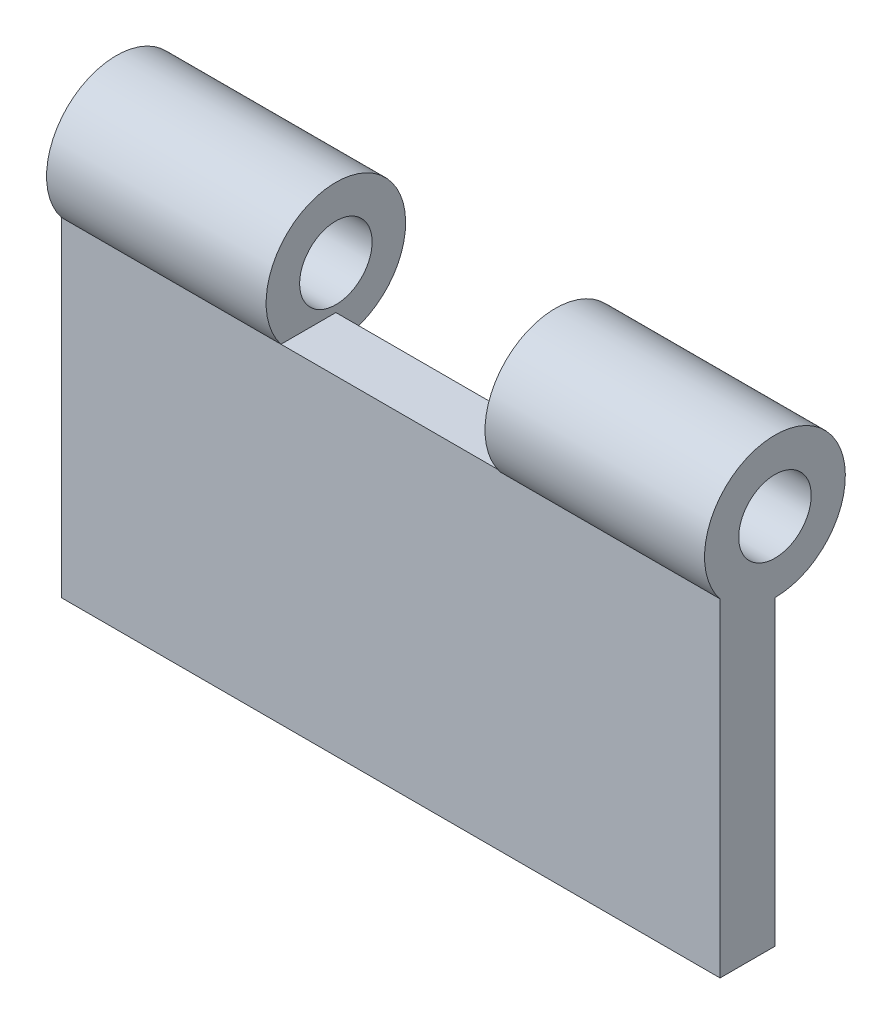
ISO-10303-21;
HEADER;
FILE_DESCRIPTION(('STEP AP214'),'2;1');
FILE_NAME('part.step','',(''),(''),'','','');
FILE_SCHEMA(('AUTOMOTIVE_DESIGN { 1 0 10303 214 1 1 1 1 }'));
ENDSEC;
DATA;
#1=APPLICATION_CONTEXT('core data for automotive mechanical design processes');
#2=APPLICATION_PROTOCOL_DEFINITION('international standard','automotive_design',2000,#1);
#3=PRODUCT_CONTEXT('',#1,'mechanical');
#4=PRODUCT('Part','Part','',(#3));
#5=PRODUCT_RELATED_PRODUCT_CATEGORY('part','',(#4));
#6=PRODUCT_DEFINITION_FORMATION('','',#4);
#7=PRODUCT_DEFINITION_CONTEXT('part definition',#1,'design');
#8=PRODUCT_DEFINITION('design','',#6,#7);
#9=PRODUCT_DEFINITION_SHAPE('','',#8);
#10=(LENGTH_UNIT() NAMED_UNIT(*) SI_UNIT(.MILLI.,.METRE.));
#11=(NAMED_UNIT(*) PLANE_ANGLE_UNIT() SI_UNIT($,.RADIAN.));
#12=(NAMED_UNIT(*) SI_UNIT($,.STERADIAN.) SOLID_ANGLE_UNIT());
#13=UNCERTAINTY_MEASURE_WITH_UNIT(LENGTH_MEASURE(1.E-05),#10,'distance_accuracy_value','');
#14=(GEOMETRIC_REPRESENTATION_CONTEXT(3) GLOBAL_UNCERTAINTY_ASSIGNED_CONTEXT((#13)) GLOBAL_UNIT_ASSIGNED_CONTEXT((#10,
#11,#12)) REPRESENTATION_CONTEXT('',''));
#15=CARTESIAN_POINT('',(0.,0.,0.));
#16=DIRECTION('',(0.,0.,1.));
#17=DIRECTION('',(1.,0.,0.));
#18=AXIS2_PLACEMENT_3D('',#15,#16,#17);
#19=CARTESIAN_POINT('',(0.,0.,5.));
#20=DIRECTION('',(0.,-1.,0.));
#21=DIRECTION('',(0.,0.,-1.));
#22=AXIS2_PLACEMENT_3D('',#19,#20,#21);
#23=PLANE('',#22);
#24=DIRECTION('',(0.,0.,-1.));
#25=VECTOR('',#24,1.);
#26=CARTESIAN_POINT('',(20.,0.,5.));
#27=LINE('',#26,#25);
#28=CARTESIAN_POINT('',(20.,0.,5.));
#29=VERTEX_POINT('',#28);
#30=CARTESIAN_POINT('',(20.,0.,0.));
#31=VERTEX_POINT('',#30);
#32=EDGE_CURVE('E119',#29,#31,#27,.T.);
#33=ORIENTED_EDGE('',*,*,#32,.F.);
#34=DIRECTION('',(-1.,0.,0.));
#35=VECTOR('',#34,1.);
#36=CARTESIAN_POINT('',(0.,0.,5.));
#37=LINE('',#36,#35);
#38=CARTESIAN_POINT('',(40.,0.,5.));
#39=VERTEX_POINT('',#38);
#40=EDGE_CURVE('E89',#39,#29,#37,.T.);
#41=ORIENTED_EDGE('',*,*,#40,.F.);
#42=DIRECTION('',(0.,0.,1.));
#43=VECTOR('',#42,1.);
#44=CARTESIAN_POINT('',(40.,0.,5.));
#45=LINE('',#44,#43);
#46=CARTESIAN_POINT('',(40.,0.,0.));
#47=VERTEX_POINT('',#46);
#48=EDGE_CURVE('E141',#47,#39,#45,.T.);
#49=ORIENTED_EDGE('',*,*,#48,.F.);
#50=DIRECTION('',(-1.,0.,0.));
#51=VECTOR('',#50,1.);
#52=CARTESIAN_POINT('',(0.,0.,0.));
#53=LINE('',#52,#51);
#54=EDGE_CURVE('E96',#47,#31,#53,.T.);
#55=ORIENTED_EDGE('',*,*,#54,.T.);
#56=EDGE_LOOP('',(#33,#41,#49,#55));
#57=FACE_BOUND('',#56,.T.);
#58=ADVANCED_FACE('F33',(#57),#23,.F.);
#59=CARTESIAN_POINT('',(0.,0.,5.));
#60=DIRECTION('',(1.,0.,0.));
#61=DIRECTION('',(0.,0.,-1.));
#62=AXIS2_PLACEMENT_3D('',#59,#60,#61);
#63=PLANE('',#62);
#64=DIRECTION('',(0.,-1.,0.));
#65=VECTOR('',#64,1.);
#66=CARTESIAN_POINT('',(0.,0.,5.));
#67=LINE('',#66,#65);
#68=CARTESIAN_POINT('',(0.,0.,5.));
#69=VERTEX_POINT('',#68);
#70=CARTESIAN_POINT('',(0.,-30.,5.));
#71=VERTEX_POINT('',#70);
#72=EDGE_CURVE('E99',#69,#71,#67,.T.);
#73=ORIENTED_EDGE('',*,*,#72,.F.);
#74=CARTESIAN_POINT('',(0.,3.92435949552473,0.));
#75=DIRECTION('',(-1.,0.,0.));
#76=DIRECTION('',(0.,0.,1.));
#77=AXIS2_PLACEMENT_3D('',#74,#75,#76);
#78=CIRCLE('',#77,6.35614643082702);
#79=CARTESIAN_POINT('',(0.,-2.4317869353023,0.));
#80=VERTEX_POINT('',#79);
#81=EDGE_CURVE('E48',#69,#80,#78,.T.);
#82=ORIENTED_EDGE('',*,*,#81,.T.);
#83=DIRECTION('',(0.,-1.,0.));
#84=VECTOR('',#83,1.);
#85=CARTESIAN_POINT('',(0.,0.,0.));
#86=LINE('',#85,#84);
#87=CARTESIAN_POINT('',(0.,-30.,0.));
#88=VERTEX_POINT('',#87);
#89=EDGE_CURVE('E80',#80,#88,#86,.T.);
#90=ORIENTED_EDGE('',*,*,#89,.T.);
#91=DIRECTION('',(0.,0.,-1.));
#92=VECTOR('',#91,1.);
#93=CARTESIAN_POINT('',(0.,-30.,5.));
#94=LINE('',#93,#92);
#95=EDGE_CURVE('E75',#71,#88,#94,.T.);
#96=ORIENTED_EDGE('',*,*,#95,.F.);
#97=EDGE_LOOP('',(#73,#82,#90,#96));
#98=FACE_BOUND('',#97,.T.);
#99=CARTESIAN_POINT('',(0.,3.92435949552473,0.));
#100=DIRECTION('',(-1.,0.,0.));
#101=DIRECTION('',(0.,0.,1.));
#102=AXIS2_PLACEMENT_3D('',#99,#100,#101);
#103=CIRCLE('',#102,3.30292672279423);
#104=CARTESIAN_POINT('',(0.,3.92435949552473,3.30292672279423));
#105=VERTEX_POINT('',#104);
#106=EDGE_CURVE('E159',#105,#105,#103,.T.);
#107=ORIENTED_EDGE('',*,*,#106,.F.);
#108=EDGE_LOOP('',(#107));
#109=FACE_BOUND('',#108,.T.);
#110=ADVANCED_FACE('F35',(#98,#109),#63,.F.);
#111=CARTESIAN_POINT('',(0.,-30.,5.));
#112=DIRECTION('',(0.,1.,0.));
#113=DIRECTION('',(0.,0.,1.));
#114=AXIS2_PLACEMENT_3D('',#111,#112,#113);
#115=PLANE('',#114);
#116=DIRECTION('',(1.,0.,0.));
#117=VECTOR('',#116,1.);
#118=CARTESIAN_POINT('',(0.,-30.,0.));
#119=LINE('',#118,#117);
#120=CARTESIAN_POINT('',(60.,-30.,0.));
#121=VERTEX_POINT('',#120);
#122=EDGE_CURVE('E69',#88,#121,#119,.T.);
#123=ORIENTED_EDGE('',*,*,#122,.T.);
#124=DIRECTION('',(0.,0.,-1.));
#125=VECTOR('',#124,1.);
#126=CARTESIAN_POINT('',(60.,-30.,5.));
#127=LINE('',#126,#125);
#128=CARTESIAN_POINT('',(60.,-30.,5.));
#129=VERTEX_POINT('',#128);
#130=EDGE_CURVE('E72',#129,#121,#127,.T.);
#131=ORIENTED_EDGE('',*,*,#130,.F.);
#132=DIRECTION('',(1.,0.,0.));
#133=VECTOR('',#132,1.);
#134=CARTESIAN_POINT('',(0.,-30.,5.));
#135=LINE('',#134,#133);
#136=EDGE_CURVE('E57',#71,#129,#135,.T.);
#137=ORIENTED_EDGE('',*,*,#136,.F.);
#138=ORIENTED_EDGE('',*,*,#95,.T.);
#139=EDGE_LOOP('',(#123,#131,#137,#138));
#140=FACE_BOUND('',#139,.T.);
#141=ADVANCED_FACE('F71',(#140),#115,.F.);
#142=CARTESIAN_POINT('',(60.,0.,5.));
#143=DIRECTION('',(-1.,0.,0.));
#144=DIRECTION('',(0.,-1.,0.));
#145=AXIS2_PLACEMENT_3D('',#142,#143,#144);
#146=PLANE('',#145);
#147=DIRECTION('',(0.,1.,0.));
#148=VECTOR('',#147,1.);
#149=CARTESIAN_POINT('',(60.,0.,0.));
#150=LINE('',#149,#148);
#151=CARTESIAN_POINT('',(60.,-2.48927988427875,0.));
#152=VERTEX_POINT('',#151);
#153=EDGE_CURVE('E79',#121,#152,#150,.T.);
#154=ORIENTED_EDGE('',*,*,#153,.T.);
#155=CARTESIAN_POINT('',(60.,3.92435949552474,0.));
#156=DIRECTION('',(1.,0.,0.));
#157=DIRECTION('',(0.,0.,-1.));
#158=AXIS2_PLACEMENT_3D('',#155,#156,#157);
#159=CIRCLE('',#158,6.41363937980349);
#160=CARTESIAN_POINT('',(60.,-0.092451440300608,5.));
#161=VERTEX_POINT('',#160);
#162=EDGE_CURVE('E145',#152,#161,#159,.T.);
#163=ORIENTED_EDGE('',*,*,#162,.T.);
#164=DIRECTION('',(0.,1.,0.));
#165=VECTOR('',#164,1.);
#166=CARTESIAN_POINT('',(60.,0.,5.));
#167=LINE('',#166,#165);
#168=EDGE_CURVE('E88',#129,#161,#167,.T.);
#169=ORIENTED_EDGE('',*,*,#168,.F.);
#170=ORIENTED_EDGE('',*,*,#130,.T.);
#171=EDGE_LOOP('',(#154,#163,#169,#170));
#172=FACE_BOUND('',#171,.T.);
#173=CARTESIAN_POINT('',(60.,3.92435949552474,0.));
#174=DIRECTION('',(1.,0.,0.));
#175=DIRECTION('',(0.,0.,-1.));
#176=AXIS2_PLACEMENT_3D('',#173,#174,#175);
#177=CIRCLE('',#176,3.30292672279423);
#178=CARTESIAN_POINT('',(60.,3.92435949552474,-3.30292672279423));
#179=VERTEX_POINT('',#178);
#180=EDGE_CURVE('E150',#179,#179,#177,.T.);
#181=ORIENTED_EDGE('',*,*,#180,.F.);
#182=EDGE_LOOP('',(#181));
#183=FACE_BOUND('',#182,.T.);
#184=ADVANCED_FACE('F84',(#172,#183),#146,.F.);
#185=CARTESIAN_POINT('',(0.,0.,5.));
#186=DIRECTION('',(0.,0.,1.));
#187=DIRECTION('',(1.,0.,0.));
#188=AXIS2_PLACEMENT_3D('',#185,#186,#187);
#189=PLANE('',#188);
#190=DIRECTION('',(1.,0.,0.));
#191=VECTOR('',#190,1.);
#192=CARTESIAN_POINT('',(40.,-0.092451440300608,5.));
#193=LINE('',#192,#191);
#194=CARTESIAN_POINT('',(40.,-0.092451440300608,5.));
#195=VERTEX_POINT('',#194);
#196=EDGE_CURVE('E129',#195,#161,#193,.T.);
#197=ORIENTED_EDGE('',*,*,#196,.F.);
#198=DIRECTION('',(0.,1.,0.));
#199=VECTOR('',#198,1.);
#200=CARTESIAN_POINT('',(40.,0.,5.));
#201=LINE('',#200,#199);
#202=EDGE_CURVE('E131',#195,#39,#201,.T.);
#203=ORIENTED_EDGE('',*,*,#202,.T.);
#204=ORIENTED_EDGE('',*,*,#40,.T.);
#205=DIRECTION('',(-1.,0.,0.));
#206=VECTOR('',#205,1.);
#207=CARTESIAN_POINT('',(20.,0.,5.));
#208=LINE('',#207,#206);
#209=EDGE_CURVE('E127',#69,#29,#208,.F.);
#210=ORIENTED_EDGE('',*,*,#209,.F.);
#211=ORIENTED_EDGE('',*,*,#72,.T.);
#212=ORIENTED_EDGE('',*,*,#136,.T.);
#213=ORIENTED_EDGE('',*,*,#168,.T.);
#214=EDGE_LOOP('',(#197,#203,#204,#210,#211,#212,#213));
#215=FACE_BOUND('',#214,.T.);
#216=ADVANCED_FACE('F181',(#215),#189,.T.);
#217=CARTESIAN_POINT('',(0.,0.,0.));
#218=DIRECTION('',(0.,0.,1.));
#219=DIRECTION('',(1.,0.,0.));
#220=AXIS2_PLACEMENT_3D('',#217,#218,#219);
#221=PLANE('',#220);
#222=ORIENTED_EDGE('',*,*,#89,.F.);
#223=DIRECTION('',(-1.,0.,0.));
#224=VECTOR('',#223,1.);
#225=CARTESIAN_POINT('',(20.,-2.4317869353023,0.));
#226=LINE('',#225,#224);
#227=CARTESIAN_POINT('',(20.,-2.4317869353023,0.));
#228=VERTEX_POINT('',#227);
#229=EDGE_CURVE('E11',#80,#228,#226,.F.);
#230=ORIENTED_EDGE('',*,*,#229,.T.);
#231=DIRECTION('',(0.,-1.,0.));
#232=VECTOR('',#231,1.);
#233=CARTESIAN_POINT('',(20.,0.,0.));
#234=LINE('',#233,#232);
#235=EDGE_CURVE('E41',#31,#228,#234,.T.);
#236=ORIENTED_EDGE('',*,*,#235,.F.);
#237=ORIENTED_EDGE('',*,*,#54,.F.);
#238=DIRECTION('',(0.,1.,0.));
#239=VECTOR('',#238,1.);
#240=CARTESIAN_POINT('',(40.,0.,0.));
#241=LINE('',#240,#239);
#242=CARTESIAN_POINT('',(40.,-2.48927988427875,0.));
#243=VERTEX_POINT('',#242);
#244=EDGE_CURVE('E104',#243,#47,#241,.T.);
#245=ORIENTED_EDGE('',*,*,#244,.F.);
#246=DIRECTION('',(1.,0.,0.));
#247=VECTOR('',#246,1.);
#248=CARTESIAN_POINT('',(40.,-2.48927988427875,0.));
#249=LINE('',#248,#247);
#250=EDGE_CURVE('E95',#243,#152,#249,.T.);
#251=ORIENTED_EDGE('',*,*,#250,.T.);
#252=ORIENTED_EDGE('',*,*,#153,.F.);
#253=ORIENTED_EDGE('',*,*,#122,.F.);
#254=EDGE_LOOP('',(#222,#230,#236,#237,#245,#251,#252,#253));
#255=FACE_BOUND('',#254,.T.);
#256=ADVANCED_FACE('F92',(#255),#221,.F.);
#257=CARTESIAN_POINT('',(40.,3.92435949552474,0.));
#258=DIRECTION('',(1.,0.,0.));
#259=DIRECTION('',(0.,0.,-1.));
#260=AXIS2_PLACEMENT_3D('',#257,#258,#259);
#261=CYLINDRICAL_SURFACE('',#260,6.41363937980349);
#262=CARTESIAN_POINT('',(40.,3.92435949552474,0.));
#263=DIRECTION('',(1.,0.,0.));
#264=DIRECTION('',(0.,0.,-1.));
#265=AXIS2_PLACEMENT_3D('',#262,#263,#264);
#266=CIRCLE('',#265,6.41363937980349);
#267=EDGE_CURVE('E144',#243,#195,#266,.T.);
#268=ORIENTED_EDGE('',*,*,#267,.T.);
#269=ORIENTED_EDGE('',*,*,#196,.T.);
#270=ORIENTED_EDGE('',*,*,#162,.F.);
#271=ORIENTED_EDGE('',*,*,#250,.F.);
#272=EDGE_LOOP('',(#268,#269,#270,#271));
#273=FACE_BOUND('',#272,.T.);
#274=ADVANCED_FACE('F199',(#273),#261,.T.);
#275=CARTESIAN_POINT('',(40.,3.92435949552474,0.));
#276=DIRECTION('',(1.,0.,0.));
#277=DIRECTION('',(0.,0.,-1.));
#278=AXIS2_PLACEMENT_3D('',#275,#276,#277);
#279=PLANE('',#278);
#280=ORIENTED_EDGE('',*,*,#202,.F.);
#281=ORIENTED_EDGE('',*,*,#267,.F.);
#282=ORIENTED_EDGE('',*,*,#244,.T.);
#283=ORIENTED_EDGE('',*,*,#48,.T.);
#284=EDGE_LOOP('',(#280,#281,#282,#283));
#285=FACE_BOUND('',#284,.T.);
#286=CARTESIAN_POINT('',(40.,3.92435949552474,0.));
#287=DIRECTION('',(1.,0.,0.));
#288=DIRECTION('',(0.,0.,-1.));
#289=AXIS2_PLACEMENT_3D('',#286,#287,#288);
#290=CIRCLE('',#289,3.30292672279423);
#291=CARTESIAN_POINT('',(40.,3.92435949552474,-3.30292672279423));
#292=VERTEX_POINT('',#291);
#293=EDGE_CURVE('E147',#292,#292,#290,.T.);
#294=ORIENTED_EDGE('',*,*,#293,.T.);
#295=EDGE_LOOP('',(#294));
#296=FACE_BOUND('',#295,.T.);
#297=ADVANCED_FACE('F201',(#285,#296),#279,.F.);
#298=CARTESIAN_POINT('',(40.,3.92435949552474,0.));
#299=DIRECTION('',(1.,0.,0.));
#300=DIRECTION('',(0.,0.,-1.));
#301=AXIS2_PLACEMENT_3D('',#298,#299,#300);
#302=CYLINDRICAL_SURFACE('',#301,3.30292672279423);
#303=ORIENTED_EDGE('',*,*,#293,.F.);
#304=EDGE_LOOP('',(#303));
#305=FACE_BOUND('',#304,.T.);
#306=ORIENTED_EDGE('',*,*,#180,.T.);
#307=EDGE_LOOP('',(#306));
#308=FACE_BOUND('',#307,.T.);
#309=ADVANCED_FACE('F204',(#305,#308),#302,.F.);
#310=CARTESIAN_POINT('',(20.,3.92435949552473,0.));
#311=DIRECTION('',(-1.,0.,0.));
#312=DIRECTION('',(0.,0.,1.));
#313=AXIS2_PLACEMENT_3D('',#310,#311,#312);
#314=PLANE('',#313);
#315=CARTESIAN_POINT('',(20.,3.92435949552473,0.));
#316=DIRECTION('',(-1.,0.,0.));
#317=DIRECTION('',(0.,0.,1.));
#318=AXIS2_PLACEMENT_3D('',#315,#316,#317);
#319=CIRCLE('',#318,3.30292672279423);
#320=CARTESIAN_POINT('',(20.,3.92435949552473,3.30292672279423));
#321=VERTEX_POINT('',#320);
#322=EDGE_CURVE('E157',#321,#321,#319,.T.);
#323=ORIENTED_EDGE('',*,*,#322,.T.);
#324=EDGE_LOOP('',(#323));
#325=FACE_BOUND('',#324,.T.);
#326=CARTESIAN_POINT('',(20.,3.92435949552473,0.));
#327=DIRECTION('',(-1.,0.,0.));
#328=DIRECTION('',(0.,0.,1.));
#329=AXIS2_PLACEMENT_3D('',#326,#327,#328);
#330=CIRCLE('',#329,6.35614643082702);
#331=EDGE_CURVE('E116',#29,#228,#330,.T.);
#332=ORIENTED_EDGE('',*,*,#331,.F.);
#333=ORIENTED_EDGE('',*,*,#32,.T.);
#334=ORIENTED_EDGE('',*,*,#235,.T.);
#335=EDGE_LOOP('',(#332,#333,#334));
#336=FACE_BOUND('',#335,.T.);
#337=ADVANCED_FACE('F114',(#325,#336),#314,.F.);
#338=CARTESIAN_POINT('',(20.,3.92435949552473,0.));
#339=DIRECTION('',(-1.,0.,0.));
#340=DIRECTION('',(0.,0.,1.));
#341=AXIS2_PLACEMENT_3D('',#338,#339,#340);
#342=CYLINDRICAL_SURFACE('',#341,6.35614643082702);
#343=ORIENTED_EDGE('',*,*,#81,.F.);
#344=ORIENTED_EDGE('',*,*,#209,.T.);
#345=ORIENTED_EDGE('',*,*,#331,.T.);
#346=ORIENTED_EDGE('',*,*,#229,.F.);
#347=EDGE_LOOP('',(#343,#344,#345,#346));
#348=FACE_BOUND('',#347,.T.);
#349=ADVANCED_FACE('F125',(#348),#342,.T.);
#350=CARTESIAN_POINT('',(20.,3.92435949552473,0.));
#351=DIRECTION('',(-1.,0.,0.));
#352=DIRECTION('',(0.,0.,1.));
#353=AXIS2_PLACEMENT_3D('',#350,#351,#352);
#354=CYLINDRICAL_SURFACE('',#353,3.30292672279423);
#355=ORIENTED_EDGE('',*,*,#322,.F.);
#356=EDGE_LOOP('',(#355));
#357=FACE_BOUND('',#356,.T.);
#358=ORIENTED_EDGE('',*,*,#106,.T.);
#359=EDGE_LOOP('',(#358));
#360=FACE_BOUND('',#359,.T.);
#361=ADVANCED_FACE('F166',(#357,#360),#354,.F.);
#362=CLOSED_SHELL('',(#58,#110,#141,#184,#216,#256,#274,#297,#309,#337,#349,#361));
#363=MANIFOLD_SOLID_BREP('B2',#362);
#364=ADVANCED_BREP_SHAPE_REPRESENTATION('',(#18,#363),#14);
#365=SHAPE_DEFINITION_REPRESENTATION(#9,#364);
ENDSEC;
END-ISO-10303-21;
